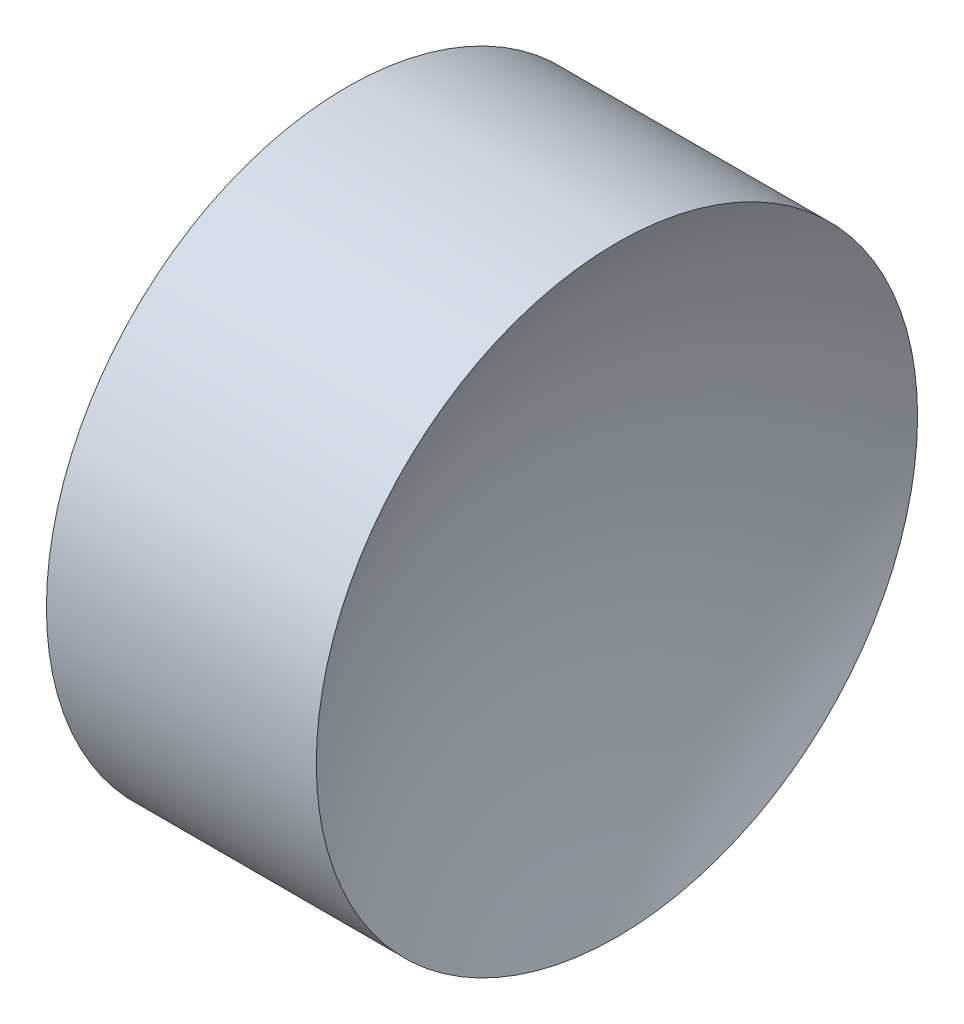
ISO-10303-21;
HEADER;
FILE_DESCRIPTION(('STEP AP214'),'2;1');
FILE_NAME('part.step','',(''),(''),'','','');
FILE_SCHEMA(('AUTOMOTIVE_DESIGN { 1 0 10303 214 1 1 1 1 }'));
ENDSEC;
DATA;
#1=APPLICATION_CONTEXT('core data for automotive mechanical design processes');
#2=APPLICATION_PROTOCOL_DEFINITION('international standard','automotive_design',2000,#1);
#3=PRODUCT_CONTEXT('',#1,'mechanical');
#4=PRODUCT('Part','Part','',(#3));
#5=PRODUCT_RELATED_PRODUCT_CATEGORY('part','',(#4));
#6=PRODUCT_DEFINITION_FORMATION('','',#4);
#7=PRODUCT_DEFINITION_CONTEXT('part definition',#1,'design');
#8=PRODUCT_DEFINITION('design','',#6,#7);
#9=PRODUCT_DEFINITION_SHAPE('','',#8);
#10=(LENGTH_UNIT() NAMED_UNIT(*) SI_UNIT(.MILLI.,.METRE.));
#11=(NAMED_UNIT(*) PLANE_ANGLE_UNIT() SI_UNIT($,.RADIAN.));
#12=(NAMED_UNIT(*) SI_UNIT($,.STERADIAN.) SOLID_ANGLE_UNIT());
#13=UNCERTAINTY_MEASURE_WITH_UNIT(LENGTH_MEASURE(1.E-05),#10,'distance_accuracy_value','');
#14=(GEOMETRIC_REPRESENTATION_CONTEXT(3) GLOBAL_UNCERTAINTY_ASSIGNED_CONTEXT((#13)) GLOBAL_UNIT_ASSIGNED_CONTEXT((#10,
#11,#12)) REPRESENTATION_CONTEXT('',''));
#15=CARTESIAN_POINT('',(0.,0.,0.));
#16=DIRECTION('',(0.,0.,1.));
#17=DIRECTION('',(1.,0.,0.));
#18=AXIS2_PLACEMENT_3D('',#15,#16,#17);
#19=CARTESIAN_POINT('',(33.39522198418,26.089041149195,0.));
#20=DIRECTION('',(-1.,0.,0.));
#21=DIRECTION('',(0.,1.,0.));
#22=AXIS2_PLACEMENT_3D('',#19,#20,#21);
#23=SPHERICAL_SURFACE('',#22,13.4);
#24=CARTESIAN_POINT('',(45.1951160515011,26.089041149195,0.));
#25=DIRECTION('',(-1.,0.,0.));
#26=DIRECTION('',(0.,0.,1.));
#27=AXIS2_PLACEMENT_3D('',#24,#25,#26);
#28=CIRCLE('',#27,6.35);
#29=CARTESIAN_POINT('',(45.1951160515011,26.089041149195,6.35));
#30=VERTEX_POINT('',#29);
#31=EDGE_CURVE('E41',#30,#30,#28,.T.);
#32=ORIENTED_EDGE('',*,*,#31,.T.);
#33=EDGE_LOOP('',(#32));
#34=FACE_BOUND('',#33,.T.);
#35=ADVANCED_FACE('F35',(#34),#23,.F.);
#36=CARTESIAN_POINT('',(62.69522198418,26.089041149195,0.));
#37=DIRECTION('',(-1.,0.,0.));
#38=DIRECTION('',(0.,-1.,0.));
#39=AXIS2_PLACEMENT_3D('',#36,#37,#38);
#40=SPHERICAL_SURFACE('',#39,13.4);
#41=CARTESIAN_POINT('',(50.8953279168589,26.089041149195,0.));
#42=DIRECTION('',(-1.,0.,0.));
#43=DIRECTION('',(0.,0.,1.));
#44=AXIS2_PLACEMENT_3D('',#41,#42,#43);
#45=CIRCLE('',#44,6.35000000000001);
#46=CARTESIAN_POINT('',(50.8953279168589,26.089041149195,6.35000000000001));
#47=VERTEX_POINT('',#46);
#48=EDGE_CURVE('E10',#47,#47,#45,.T.);
#49=ORIENTED_EDGE('',*,*,#48,.F.);
#50=EDGE_LOOP('',(#49));
#51=FACE_BOUND('',#50,.T.);
#52=ADVANCED_FACE('F50',(#51),#40,.F.);
#53=CARTESIAN_POINT('',(42.4498611141368,26.089041149195,0.));
#54=DIRECTION('',(-1.,0.,0.));
#55=DIRECTION('',(0.,0.,1.));
#56=AXIS2_PLACEMENT_3D('',#53,#54,#55);
#57=CYLINDRICAL_SURFACE('',#56,6.35);
#58=ORIENTED_EDGE('',*,*,#31,.F.);
#59=EDGE_LOOP('',(#58));
#60=FACE_BOUND('',#59,.T.);
#61=ORIENTED_EDGE('',*,*,#48,.T.);
#62=EDGE_LOOP('',(#61));
#63=FACE_BOUND('',#62,.T.);
#64=ADVANCED_FACE('F48',(#60,#63),#57,.T.);
#65=CLOSED_SHELL('',(#35,#52,#64));
#66=MANIFOLD_SOLID_BREP('B2',#65);
#67=ADVANCED_BREP_SHAPE_REPRESENTATION('',(#18,#66),#14);
#68=SHAPE_DEFINITION_REPRESENTATION(#9,#67);
ENDSEC;
END-ISO-10303-21;
